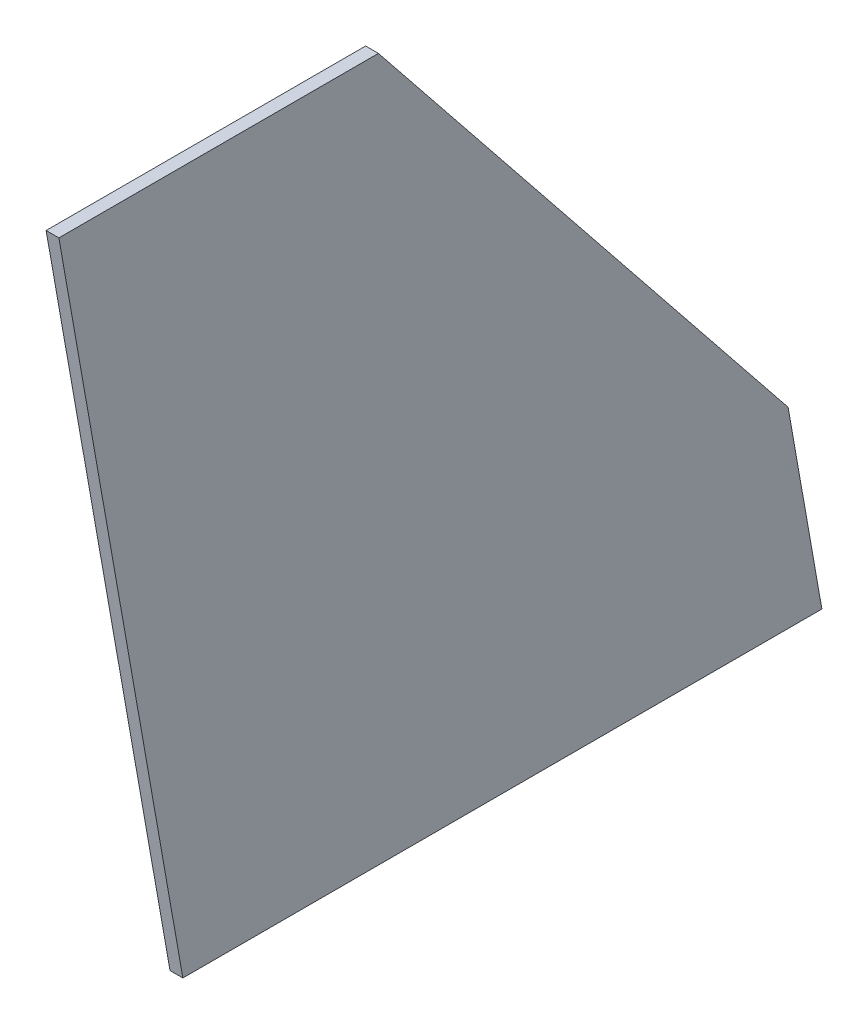
ISO-10303-21;
HEADER;
FILE_DESCRIPTION(('STEP AP214'),'2;1');
FILE_NAME('part.step','',(''),(''),'','','');
FILE_SCHEMA(('AUTOMOTIVE_DESIGN { 1 0 10303 214 1 1 1 1 }'));
ENDSEC;
DATA;
#1=APPLICATION_CONTEXT('core data for automotive mechanical design processes');
#2=APPLICATION_PROTOCOL_DEFINITION('international standard','automotive_design',2000,#1);
#3=PRODUCT_CONTEXT('',#1,'mechanical');
#4=PRODUCT('Part','Part','',(#3));
#5=PRODUCT_RELATED_PRODUCT_CATEGORY('part','',(#4));
#6=PRODUCT_DEFINITION_FORMATION('','',#4);
#7=PRODUCT_DEFINITION_CONTEXT('part definition',#1,'design');
#8=PRODUCT_DEFINITION('design','',#6,#7);
#9=PRODUCT_DEFINITION_SHAPE('','',#8);
#10=(LENGTH_UNIT() NAMED_UNIT(*) SI_UNIT(.MILLI.,.METRE.));
#11=(NAMED_UNIT(*) PLANE_ANGLE_UNIT() SI_UNIT($,.RADIAN.));
#12=(NAMED_UNIT(*) SI_UNIT($,.STERADIAN.) SOLID_ANGLE_UNIT());
#13=UNCERTAINTY_MEASURE_WITH_UNIT(LENGTH_MEASURE(1.E-05),#10,'distance_accuracy_value','');
#14=(GEOMETRIC_REPRESENTATION_CONTEXT(3) GLOBAL_UNCERTAINTY_ASSIGNED_CONTEXT((#13)) GLOBAL_UNIT_ASSIGNED_CONTEXT((#10,
#11,#12)) REPRESENTATION_CONTEXT('',''));
#15=CARTESIAN_POINT('',(0.,0.,0.));
#16=DIRECTION('',(0.,0.,1.));
#17=DIRECTION('',(1.,0.,0.));
#18=AXIS2_PLACEMENT_3D('',#15,#16,#17);
#19=CARTESIAN_POINT('',(-1.27,139.7,-38.8671207950279));
#20=DIRECTION('',(0.,1.,0.));
#21=DIRECTION('',(0.,0.,1.));
#22=AXIS2_PLACEMENT_3D('',#19,#20,#21);
#23=PLANE('',#22);
#24=DIRECTION('',(1.,0.,0.));
#25=VECTOR('',#24,1.);
#26=CARTESIAN_POINT('',(-1.27,139.7,24.6328792049721));
#27=LINE('',#26,#25);
#28=CARTESIAN_POINT('',(-1.27,139.7,24.6328792049721));
#29=VERTEX_POINT('',#28);
#30=CARTESIAN_POINT('',(1.27,139.7,24.6328792049721));
#31=VERTEX_POINT('',#30);
#32=EDGE_CURVE('E39',#29,#31,#27,.T.);
#33=ORIENTED_EDGE('',*,*,#32,.T.);
#34=DIRECTION('',(0.,0.,1.));
#35=VECTOR('',#34,1.);
#36=CARTESIAN_POINT('',(1.27,139.7,-38.8671207950279));
#37=LINE('',#36,#35);
#38=CARTESIAN_POINT('',(1.27,139.7,-38.8671207950279));
#39=VERTEX_POINT('',#38);
#40=EDGE_CURVE('E82',#39,#31,#37,.T.);
#41=ORIENTED_EDGE('',*,*,#40,.F.);
#42=DIRECTION('',(1.,0.,0.));
#43=VECTOR('',#42,1.);
#44=CARTESIAN_POINT('',(-1.27,139.7,-38.8671207950279));
#45=LINE('',#44,#43);
#46=CARTESIAN_POINT('',(-1.27,139.7,-38.8671207950279));
#47=VERTEX_POINT('',#46);
#48=EDGE_CURVE('E11',#47,#39,#45,.T.);
#49=ORIENTED_EDGE('',*,*,#48,.F.);
#50=DIRECTION('',(0.,0.,1.));
#51=VECTOR('',#50,1.);
#52=CARTESIAN_POINT('',(-1.27,139.7,-38.8671207950279));
#53=LINE('',#52,#51);
#54=EDGE_CURVE('E83',#47,#29,#53,.T.);
#55=ORIENTED_EDGE('',*,*,#54,.T.);
#56=EDGE_LOOP('',(#33,#41,#49,#55));
#57=FACE_BOUND('',#56,.T.);
#58=ADVANCED_FACE('F36',(#57),#23,.T.);
#59=CARTESIAN_POINT('',(-1.27,38.1,-120.281942035007));
#60=DIRECTION('',(0.,0.625326262351394,-0.780363418936098));
#61=DIRECTION('',(0.,0.780363418936098,0.625326262351394));
#62=AXIS2_PLACEMENT_3D('',#59,#60,#61);
#63=PLANE('',#62);
#64=ORIENTED_EDGE('',*,*,#48,.T.);
#65=DIRECTION('',(0.,0.780363418936098,0.625326262351394));
#66=VECTOR('',#65,1.);
#67=CARTESIAN_POINT('',(1.27,38.1,-120.281942035007));
#68=LINE('',#67,#66);
#69=CARTESIAN_POINT('',(1.27,38.1,-120.281942035007));
#70=VERTEX_POINT('',#69);
#71=EDGE_CURVE('E100',#70,#39,#68,.T.);
#72=ORIENTED_EDGE('',*,*,#71,.F.);
#73=DIRECTION('',(1.,0.,0.));
#74=VECTOR('',#73,1.);
#75=CARTESIAN_POINT('',(-1.27,38.1,-120.281942035007));
#76=LINE('',#75,#74);
#77=CARTESIAN_POINT('',(-1.27,38.1,-120.281942035007));
#78=VERTEX_POINT('',#77);
#79=EDGE_CURVE('E44',#78,#70,#76,.T.);
#80=ORIENTED_EDGE('',*,*,#79,.F.);
#81=DIRECTION('',(0.,0.780363418936098,0.625326262351394));
#82=VECTOR('',#81,1.);
#83=CARTESIAN_POINT('',(-1.27,38.1,-120.281942035007));
#84=LINE('',#83,#82);
#85=EDGE_CURVE('E88',#78,#47,#84,.T.);
#86=ORIENTED_EDGE('',*,*,#85,.T.);
#87=EDGE_LOOP('',(#64,#72,#80,#86));
#88=FACE_BOUND('',#87,.T.);
#89=ADVANCED_FACE('F128',(#88),#63,.T.);
#90=CARTESIAN_POINT('',(-1.27,0.,-127.));
#91=DIRECTION('',(0.,0.173648177666935,-0.984807753012207));
#92=DIRECTION('',(0.,0.984807753012207,0.173648177666935));
#93=AXIS2_PLACEMENT_3D('',#90,#91,#92);
#94=PLANE('',#93);
#95=ORIENTED_EDGE('',*,*,#79,.T.);
#96=DIRECTION('',(0.,0.984807753012207,0.173648177666935));
#97=VECTOR('',#96,1.);
#98=CARTESIAN_POINT('',(1.27,0.,-127.));
#99=LINE('',#98,#97);
#100=CARTESIAN_POINT('',(1.27,0.,-127.));
#101=VERTEX_POINT('',#100);
#102=EDGE_CURVE('E104',#101,#70,#99,.T.);
#103=ORIENTED_EDGE('',*,*,#102,.F.);
#104=DIRECTION('',(1.,0.,0.));
#105=VECTOR('',#104,1.);
#106=CARTESIAN_POINT('',(-1.27,0.,-127.));
#107=LINE('',#106,#105);
#108=CARTESIAN_POINT('',(-1.27,0.,-127.));
#109=VERTEX_POINT('',#108);
#110=EDGE_CURVE('E117',#109,#101,#107,.T.);
#111=ORIENTED_EDGE('',*,*,#110,.F.);
#112=DIRECTION('',(0.,0.984807753012207,0.173648177666935));
#113=VECTOR('',#112,1.);
#114=CARTESIAN_POINT('',(-1.27,0.,-127.));
#115=LINE('',#114,#113);
#116=EDGE_CURVE('E113',#109,#78,#115,.T.);
#117=ORIENTED_EDGE('',*,*,#116,.T.);
#118=EDGE_LOOP('',(#95,#103,#111,#117));
#119=FACE_BOUND('',#118,.T.);
#120=ADVANCED_FACE('F124',(#119),#94,.T.);
#121=CARTESIAN_POINT('',(-1.27,0.,0.));
#122=DIRECTION('',(0.,-1.,0.));
#123=DIRECTION('',(0.,0.,-1.));
#124=AXIS2_PLACEMENT_3D('',#121,#122,#123);
#125=PLANE('',#124);
#126=ORIENTED_EDGE('',*,*,#110,.T.);
#127=DIRECTION('',(0.,0.,-1.));
#128=VECTOR('',#127,1.);
#129=CARTESIAN_POINT('',(1.27,0.,0.));
#130=LINE('',#129,#128);
#131=CARTESIAN_POINT('',(1.27,0.,0.));
#132=VERTEX_POINT('',#131);
#133=EDGE_CURVE('E95',#132,#101,#130,.T.);
#134=ORIENTED_EDGE('',*,*,#133,.F.);
#135=DIRECTION('',(1.,0.,0.));
#136=VECTOR('',#135,1.);
#137=CARTESIAN_POINT('',(-1.27,0.,0.));
#138=LINE('',#137,#136);
#139=CARTESIAN_POINT('',(-1.27,0.,0.));
#140=VERTEX_POINT('',#139);
#141=EDGE_CURVE('E87',#140,#132,#138,.T.);
#142=ORIENTED_EDGE('',*,*,#141,.F.);
#143=DIRECTION('',(0.,0.,-1.));
#144=VECTOR('',#143,1.);
#145=CARTESIAN_POINT('',(-1.27,0.,0.));
#146=LINE('',#145,#144);
#147=EDGE_CURVE('E110',#140,#109,#146,.T.);
#148=ORIENTED_EDGE('',*,*,#147,.T.);
#149=EDGE_LOOP('',(#126,#134,#142,#148));
#150=FACE_BOUND('',#149,.T.);
#151=ADVANCED_FACE('F119',(#150),#125,.T.);
#152=CARTESIAN_POINT('',(-1.27,139.7,24.6328792049721));
#153=DIRECTION('',(0.,-0.173648177666927,0.984807753012209));
#154=DIRECTION('',(0.,-0.984807753012209,-0.173648177666927));
#155=AXIS2_PLACEMENT_3D('',#152,#153,#154);
#156=PLANE('',#155);
#157=ORIENTED_EDGE('',*,*,#141,.T.);
#158=DIRECTION('',(0.,-0.984807753012209,-0.173648177666927));
#159=VECTOR('',#158,1.);
#160=CARTESIAN_POINT('',(1.27,139.7,24.6328792049721));
#161=LINE('',#160,#159);
#162=EDGE_CURVE('E90',#31,#132,#161,.T.);
#163=ORIENTED_EDGE('',*,*,#162,.F.);
#164=ORIENTED_EDGE('',*,*,#32,.F.);
#165=DIRECTION('',(0.,-0.984807753012209,-0.173648177666927));
#166=VECTOR('',#165,1.);
#167=CARTESIAN_POINT('',(-1.27,139.7,24.6328792049721));
#168=LINE('',#167,#166);
#169=EDGE_CURVE('E108',#29,#140,#168,.T.);
#170=ORIENTED_EDGE('',*,*,#169,.T.);
#171=EDGE_LOOP('',(#157,#163,#164,#170));
#172=FACE_BOUND('',#171,.T.);
#173=ADVANCED_FACE('F91',(#172),#156,.T.);
#174=CARTESIAN_POINT('',(-1.27,0.,0.));
#175=DIRECTION('',(1.,0.,0.));
#176=DIRECTION('',(0.,0.,-1.));
#177=AXIS2_PLACEMENT_3D('',#174,#175,#176);
#178=PLANE('',#177);
#179=ORIENTED_EDGE('',*,*,#54,.F.);
#180=ORIENTED_EDGE('',*,*,#85,.F.);
#181=ORIENTED_EDGE('',*,*,#116,.F.);
#182=ORIENTED_EDGE('',*,*,#147,.F.);
#183=ORIENTED_EDGE('',*,*,#169,.F.);
#184=EDGE_LOOP('',(#179,#180,#181,#182,#183));
#185=FACE_BOUND('',#184,.T.);
#186=ADVANCED_FACE('F127',(#185),#178,.F.);
#187=CARTESIAN_POINT('',(1.27,0.,0.));
#188=DIRECTION('',(1.,0.,0.));
#189=DIRECTION('',(0.,0.,-1.));
#190=AXIS2_PLACEMENT_3D('',#187,#188,#189);
#191=PLANE('',#190);
#192=ORIENTED_EDGE('',*,*,#40,.T.);
#193=ORIENTED_EDGE('',*,*,#162,.T.);
#194=ORIENTED_EDGE('',*,*,#133,.T.);
#195=ORIENTED_EDGE('',*,*,#102,.T.);
#196=ORIENTED_EDGE('',*,*,#71,.T.);
#197=EDGE_LOOP('',(#192,#193,#194,#195,#196));
#198=FACE_BOUND('',#197,.T.);
#199=ADVANCED_FACE('F98',(#198),#191,.T.);
#200=CLOSED_SHELL('',(#58,#89,#120,#151,#173,#186,#199));
#201=MANIFOLD_SOLID_BREP('B2',#200);
#202=ADVANCED_BREP_SHAPE_REPRESENTATION('',(#18,#201),#14);
#203=SHAPE_DEFINITION_REPRESENTATION(#9,#202);
ENDSEC;
END-ISO-10303-21;
